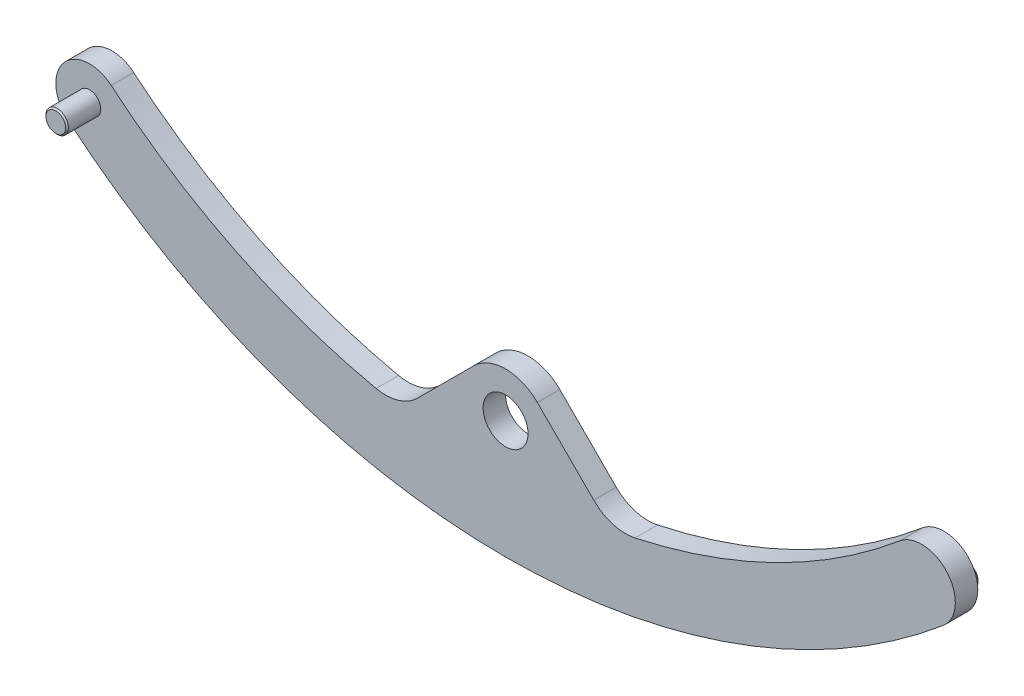
ISO-10303-21;
HEADER;
FILE_DESCRIPTION(('STEP AP214'),'2;1');
FILE_NAME('part.step','',(''),(''),'','','');
FILE_SCHEMA(('AUTOMOTIVE_DESIGN { 1 0 10303 214 1 1 1 1 }'));
ENDSEC;
DATA;
#1=APPLICATION_CONTEXT('core data for automotive mechanical design processes');
#2=APPLICATION_PROTOCOL_DEFINITION('international standard','automotive_design',2000,#1);
#3=PRODUCT_CONTEXT('',#1,'mechanical');
#4=PRODUCT('Part','Part','',(#3));
#5=PRODUCT_RELATED_PRODUCT_CATEGORY('part','',(#4));
#6=PRODUCT_DEFINITION_FORMATION('','',#4);
#7=PRODUCT_DEFINITION_CONTEXT('part definition',#1,'design');
#8=PRODUCT_DEFINITION('design','',#6,#7);
#9=PRODUCT_DEFINITION_SHAPE('','',#8);
#10=(LENGTH_UNIT() NAMED_UNIT(*) SI_UNIT(.MILLI.,.METRE.));
#11=(NAMED_UNIT(*) PLANE_ANGLE_UNIT() SI_UNIT($,.RADIAN.));
#12=(NAMED_UNIT(*) SI_UNIT($,.STERADIAN.) SOLID_ANGLE_UNIT());
#13=UNCERTAINTY_MEASURE_WITH_UNIT(LENGTH_MEASURE(1.E-05),#10,'distance_accuracy_value','');
#14=(GEOMETRIC_REPRESENTATION_CONTEXT(3) GLOBAL_UNCERTAINTY_ASSIGNED_CONTEXT((#13)) GLOBAL_UNIT_ASSIGNED_CONTEXT((#10,
#11,#12)) REPRESENTATION_CONTEXT('',''));
#15=CARTESIAN_POINT('',(0.,0.,0.));
#16=DIRECTION('',(0.,0.,1.));
#17=DIRECTION('',(1.,0.,0.));
#18=AXIS2_PLACEMENT_3D('',#15,#16,#17);
#19=CARTESIAN_POINT('',(0.,0.,4.));
#20=DIRECTION('',(0.,0.,-1.));
#21=DIRECTION('',(-1.,0.,0.));
#22=AXIS2_PLACEMENT_3D('',#19,#20,#21);
#23=CYLINDRICAL_SURFACE('',#22,4.);
#24=CARTESIAN_POINT('',(0.,0.,4.));
#25=DIRECTION('',(0.,0.,1.));
#26=DIRECTION('',(1.,0.,0.));
#27=AXIS2_PLACEMENT_3D('',#24,#25,#26);
#28=CIRCLE('',#27,4.);
#29=CARTESIAN_POINT('',(4.,0.,4.));
#30=VERTEX_POINT('',#29);
#31=EDGE_CURVE('E259',#30,#30,#28,.T.);
#32=ORIENTED_EDGE('',*,*,#31,.T.);
#33=EDGE_LOOP('',(#32));
#34=FACE_BOUND('',#33,.T.);
#35=CARTESIAN_POINT('',(0.,0.,0.));
#36=DIRECTION('',(0.,0.,1.));
#37=DIRECTION('',(1.,0.,0.));
#38=AXIS2_PLACEMENT_3D('',#35,#36,#37);
#39=CIRCLE('',#38,4.);
#40=CARTESIAN_POINT('',(4.,0.,0.));
#41=VERTEX_POINT('',#40);
#42=EDGE_CURVE('E243',#41,#41,#39,.T.);
#43=ORIENTED_EDGE('',*,*,#42,.F.);
#44=EDGE_LOOP('',(#43));
#45=FACE_BOUND('',#44,.T.);
#46=ADVANCED_FACE('F143',(#34,#45),#23,.F.);
#47=CARTESIAN_POINT('',(0.,0.,4.));
#48=DIRECTION('',(0.,0.,-1.));
#49=DIRECTION('',(-1.,0.,0.));
#50=AXIS2_PLACEMENT_3D('',#47,#48,#49);
#51=CYLINDRICAL_SURFACE('',#50,8.);
#52=CARTESIAN_POINT('',(0.,0.,0.));
#53=DIRECTION('',(0.,0.,1.));
#54=DIRECTION('',(1.,0.,0.));
#55=AXIS2_PLACEMENT_3D('',#52,#53,#54);
#56=CIRCLE('',#55,8.);
#57=CARTESIAN_POINT('',(5.65685424949237,5.65685424949239,0.));
#58=VERTEX_POINT('',#57);
#59=CARTESIAN_POINT('',(-5.65685424949237,5.65685424949239,0.));
#60=VERTEX_POINT('',#59);
#61=EDGE_CURVE('E264',#58,#60,#56,.T.);
#62=ORIENTED_EDGE('',*,*,#61,.T.);
#63=DIRECTION('',(0.,0.,-1.));
#64=VECTOR('',#63,1.);
#65=CARTESIAN_POINT('',(-5.65685424949237,5.65685424949239,4.));
#66=LINE('',#65,#64);
#67=CARTESIAN_POINT('',(-5.65685424949237,5.65685424949239,4.));
#68=VERTEX_POINT('',#67);
#69=EDGE_CURVE('E230',#68,#60,#66,.T.);
#70=ORIENTED_EDGE('',*,*,#69,.F.);
#71=CARTESIAN_POINT('',(0.,0.,4.));
#72=DIRECTION('',(0.,0.,1.));
#73=DIRECTION('',(1.,0.,0.));
#74=AXIS2_PLACEMENT_3D('',#71,#72,#73);
#75=CIRCLE('',#74,8.);
#76=CARTESIAN_POINT('',(5.65685424949237,5.65685424949239,4.));
#77=VERTEX_POINT('',#76);
#78=EDGE_CURVE('E233',#77,#68,#75,.T.);
#79=ORIENTED_EDGE('',*,*,#78,.F.);
#80=DIRECTION('',(0.,0.,-1.));
#81=VECTOR('',#80,1.);
#82=CARTESIAN_POINT('',(5.65685424949237,5.65685424949239,4.));
#83=LINE('',#82,#81);
#84=EDGE_CURVE('E218',#77,#58,#83,.T.);
#85=ORIENTED_EDGE('',*,*,#84,.T.);
#86=EDGE_LOOP('',(#62,#70,#79,#85));
#87=FACE_BOUND('',#86,.T.);
#88=ADVANCED_FACE('F234',(#87),#51,.T.);
#89=CARTESIAN_POINT('',(0.,0.,0.));
#90=DIRECTION('',(0.,0.,1.));
#91=DIRECTION('',(1.,0.,0.));
#92=AXIS2_PLACEMENT_3D('',#89,#90,#91);
#93=PLANE('',#92);
#94=CARTESIAN_POINT('',(75.3213201339913,10.4695641574083,0.));
#95=DIRECTION('',(0.,0.,1.));
#96=DIRECTION('',(1.,0.,0.));
#97=AXIS2_PLACEMENT_3D('',#94,#95,#96);
#98=CIRCLE('',#97,2.);
#99=CARTESIAN_POINT('',(77.3213201339913,10.4695641574083,0.));
#100=VERTEX_POINT('',#99);
#101=EDGE_CURVE('E303',#100,#100,#98,.F.);
#102=ORIENTED_EDGE('',*,*,#101,.F.);
#103=EDGE_LOOP('',(#102));
#104=FACE_BOUND('',#103,.T.);
#105=CARTESIAN_POINT('',(0.,100.000003802238,0.));
#106=DIRECTION('',(0.,0.,1.));
#107=DIRECTION('',(1.,0.,0.));
#108=AXIS2_PLACEMENT_3D('',#105,#106,#107);
#109=CIRCLE('',#108,121.000003802238);
#110=CARTESIAN_POINT('',(-77.8964079181355,7.40869452543266,0.));
#111=VERTEX_POINT('',#110);
#112=CARTESIAN_POINT('',(77.8964079181354,7.40869452543262,0.));
#113=VERTEX_POINT('',#112);
#114=EDGE_CURVE('E270',#111,#113,#109,.T.);
#115=ORIENTED_EDGE('',*,*,#114,.F.);
#116=CARTESIAN_POINT('',(-74.0337762419192,11.9999989733962,0.));
#117=DIRECTION('',(0.,0.,1.));
#118=DIRECTION('',(1.,0.,0.));
#119=AXIS2_PLACEMENT_3D('',#116,#117,#118);
#120=CIRCLE('',#119,5.99999999999995);
#121=CARTESIAN_POINT('',(-70.171144565703,16.5913034213598,0.));
#122=VERTEX_POINT('',#121);
#123=EDGE_CURVE('E290',#122,#111,#120,.T.);
#124=ORIENTED_EDGE('',*,*,#123,.F.);
#125=CARTESIAN_POINT('',(0.,100.000003802238,0.));
#126=DIRECTION('',(0.,0.,1.));
#127=DIRECTION('',(1.,0.,0.));
#128=AXIS2_PLACEMENT_3D('',#125,#126,#127);
#129=CIRCLE('',#128,109.000003802238);
#130=CARTESIAN_POINT('',(-23.0367257940233,-6.53783029241069,0.));
#131=VERTEX_POINT('',#130);
#132=EDGE_CURVE('E286',#122,#131,#129,.T.);
#133=ORIENTED_EDGE('',*,*,#132,.T.);
#134=CARTESIAN_POINT('',(-21.3459569873859,1.28146001058367,0.));
#135=DIRECTION('',(0.,0.,1.));
#136=DIRECTION('',(1.,0.,0.));
#137=AXIS2_PLACEMENT_3D('',#134,#135,#136);
#138=CIRCLE('',#137,8.);
#139=CARTESIAN_POINT('',(-15.6891027378935,-4.37539423890872,0.));
#140=VERTEX_POINT('',#139);
#141=EDGE_CURVE('E322',#131,#140,#138,.T.);
#142=ORIENTED_EDGE('',*,*,#141,.T.);
#143=DIRECTION('',(-0.707106781186549,-0.707106781186546,0.));
#144=VECTOR('',#143,1.);
#145=CARTESIAN_POINT('',(-5.65685424949237,5.65685424949239,0.));
#146=LINE('',#145,#144);
#147=EDGE_CURVE('E267',#60,#140,#146,.T.);
#148=ORIENTED_EDGE('',*,*,#147,.F.);
#149=ORIENTED_EDGE('',*,*,#61,.F.);
#150=DIRECTION('',(0.707106781186548,-0.707106781186547,0.));
#151=VECTOR('',#150,1.);
#152=CARTESIAN_POINT('',(5.65685424949238,5.65685424949239,0.));
#153=LINE('',#152,#151);
#154=CARTESIAN_POINT('',(15.6891027378935,-4.3753942389087,0.));
#155=VERTEX_POINT('',#154);
#156=EDGE_CURVE('E225',#58,#155,#153,.T.);
#157=ORIENTED_EDGE('',*,*,#156,.T.);
#158=CARTESIAN_POINT('',(21.3459569873858,1.28146001058367,0.));
#159=DIRECTION('',(0.,0.,1.));
#160=DIRECTION('',(1.,0.,0.));
#161=AXIS2_PLACEMENT_3D('',#158,#159,#160);
#162=CIRCLE('',#161,8.);
#163=CARTESIAN_POINT('',(23.0367257940233,-6.53783029241069,0.));
#164=VERTEX_POINT('',#163);
#165=EDGE_CURVE('E151',#155,#164,#162,.T.);
#166=ORIENTED_EDGE('',*,*,#165,.T.);
#167=CARTESIAN_POINT('',(0.,100.000003802238,0.));
#168=DIRECTION('',(0.,0.,1.));
#169=DIRECTION('',(1.,0.,0.));
#170=AXIS2_PLACEMENT_3D('',#167,#168,#169);
#171=CIRCLE('',#170,109.000003802238);
#172=CARTESIAN_POINT('',(70.1711445657029,16.5913034213598,0.));
#173=VERTEX_POINT('',#172);
#174=EDGE_CURVE('E246',#164,#173,#171,.T.);
#175=ORIENTED_EDGE('',*,*,#174,.T.);
#176=CARTESIAN_POINT('',(74.0337762419192,11.9999989733963,0.));
#177=DIRECTION('',(0.,0.,1.));
#178=DIRECTION('',(1.,0.,0.));
#179=AXIS2_PLACEMENT_3D('',#176,#177,#178);
#180=CIRCLE('',#179,5.99999999999995);
#181=EDGE_CURVE('E272',#113,#173,#180,.T.);
#182=ORIENTED_EDGE('',*,*,#181,.F.);
#183=EDGE_LOOP('',(#115,#124,#133,#142,#148,#149,#157,#166,#175,#182));
#184=FACE_BOUND('',#183,.T.);
#185=ORIENTED_EDGE('',*,*,#42,.T.);
#186=EDGE_LOOP('',(#185));
#187=FACE_BOUND('',#186,.T.);
#188=ADVANCED_FACE('F325',(#104,#184,#187),#93,.F.);
#189=CARTESIAN_POINT('',(0.,100.000003802238,4.));
#190=DIRECTION('',(0.,0.,-1.));
#191=DIRECTION('',(-1.,0.,0.));
#192=AXIS2_PLACEMENT_3D('',#189,#190,#191);
#193=CYLINDRICAL_SURFACE('',#192,121.000003802238);
#194=ORIENTED_EDGE('',*,*,#114,.T.);
#195=DIRECTION('',(0.,0.,-1.));
#196=VECTOR('',#195,1.);
#197=CARTESIAN_POINT('',(77.8964079181354,7.40869452543262,4.));
#198=LINE('',#197,#196);
#199=CARTESIAN_POINT('',(77.8964079181354,7.40869452543262,4.));
#200=VERTEX_POINT('',#199);
#201=EDGE_CURVE('E278',#200,#113,#198,.T.);
#202=ORIENTED_EDGE('',*,*,#201,.F.);
#203=CARTESIAN_POINT('',(0.,100.000003802238,4.));
#204=DIRECTION('',(0.,0.,1.));
#205=DIRECTION('',(1.,0.,0.));
#206=AXIS2_PLACEMENT_3D('',#203,#204,#205);
#207=CIRCLE('',#206,121.000003802238);
#208=CARTESIAN_POINT('',(-77.8964079181355,7.40869452543266,4.));
#209=VERTEX_POINT('',#208);
#210=EDGE_CURVE('E252',#209,#200,#207,.T.);
#211=ORIENTED_EDGE('',*,*,#210,.F.);
#212=DIRECTION('',(0.,0.,-1.));
#213=VECTOR('',#212,1.);
#214=CARTESIAN_POINT('',(-77.8964079181355,7.40869452543266,4.));
#215=LINE('',#214,#213);
#216=EDGE_CURVE('E265',#209,#111,#215,.T.);
#217=ORIENTED_EDGE('',*,*,#216,.T.);
#218=EDGE_LOOP('',(#194,#202,#211,#217));
#219=FACE_BOUND('',#218,.T.);
#220=ADVANCED_FACE('F346',(#219),#193,.T.);
#221=CARTESIAN_POINT('',(0.,100.000003802238,4.));
#222=DIRECTION('',(0.,0.,-1.));
#223=DIRECTION('',(-1.,0.,0.));
#224=AXIS2_PLACEMENT_3D('',#221,#222,#223);
#225=CYLINDRICAL_SURFACE('',#224,109.000003802238);
#226=ORIENTED_EDGE('',*,*,#174,.F.);
#227=DIRECTION('',(0.,0.,-1.));
#228=VECTOR('',#227,1.);
#229=CARTESIAN_POINT('',(23.0367257940233,-6.5378302924107,4.));
#230=LINE('',#229,#228);
#231=CARTESIAN_POINT('',(23.0367257940233,-6.53783029241069,4.));
#232=VERTEX_POINT('',#231);
#233=EDGE_CURVE('E158',#164,#232,#230,.F.);
#234=ORIENTED_EDGE('',*,*,#233,.T.);
#235=CARTESIAN_POINT('',(0.,100.000003802238,4.));
#236=DIRECTION('',(0.,0.,1.));
#237=DIRECTION('',(1.,0.,0.));
#238=AXIS2_PLACEMENT_3D('',#235,#236,#237);
#239=CIRCLE('',#238,109.000003802238);
#240=CARTESIAN_POINT('',(70.1711445657029,16.5913034213598,4.));
#241=VERTEX_POINT('',#240);
#242=EDGE_CURVE('E257',#232,#241,#239,.T.);
#243=ORIENTED_EDGE('',*,*,#242,.T.);
#244=DIRECTION('',(0.,0.,-1.));
#245=VECTOR('',#244,1.);
#246=CARTESIAN_POINT('',(70.1711445657029,16.5913034213598,4.));
#247=LINE('',#246,#245);
#248=EDGE_CURVE('E262',#241,#173,#247,.T.);
#249=ORIENTED_EDGE('',*,*,#248,.T.);
#250=EDGE_LOOP('',(#226,#234,#243,#249));
#251=FACE_BOUND('',#250,.T.);
#252=ADVANCED_FACE('F350',(#251),#225,.F.);
#253=CARTESIAN_POINT('',(74.0337762419192,11.9999989733963,4.));
#254=DIRECTION('',(0.,0.,-1.));
#255=DIRECTION('',(-1.,0.,0.));
#256=AXIS2_PLACEMENT_3D('',#253,#254,#255);
#257=CYLINDRICAL_SURFACE('',#256,5.99999999999995);
#258=ORIENTED_EDGE('',*,*,#181,.T.);
#259=ORIENTED_EDGE('',*,*,#248,.F.);
#260=CARTESIAN_POINT('',(74.0337762419192,11.9999989733963,4.));
#261=DIRECTION('',(0.,0.,1.));
#262=DIRECTION('',(1.,0.,0.));
#263=AXIS2_PLACEMENT_3D('',#260,#261,#262);
#264=CIRCLE('',#263,5.99999999999995);
#265=EDGE_CURVE('E254',#200,#241,#264,.T.);
#266=ORIENTED_EDGE('',*,*,#265,.F.);
#267=ORIENTED_EDGE('',*,*,#201,.T.);
#268=EDGE_LOOP('',(#258,#259,#266,#267));
#269=FACE_BOUND('',#268,.T.);
#270=ADVANCED_FACE('F349',(#269),#257,.T.);
#271=CARTESIAN_POINT('',(0.,0.,4.));
#272=DIRECTION('',(0.,0.,1.));
#273=DIRECTION('',(1.,0.,0.));
#274=AXIS2_PLACEMENT_3D('',#271,#272,#273);
#275=PLANE('',#274);
#276=CARTESIAN_POINT('',(-74.0337762419192,11.9999989733962,4.));
#277=DIRECTION('',(0.,0.,1.));
#278=DIRECTION('',(1.,0.,0.));
#279=AXIS2_PLACEMENT_3D('',#276,#277,#278);
#280=CIRCLE('',#279,2.);
#281=CARTESIAN_POINT('',(-72.0337762419192,11.9999989733962,4.));
#282=VERTEX_POINT('',#281);
#283=EDGE_CURVE('E249',#282,#282,#280,.T.);
#284=ORIENTED_EDGE('',*,*,#283,.F.);
#285=EDGE_LOOP('',(#284));
#286=FACE_BOUND('',#285,.T.);
#287=ORIENTED_EDGE('',*,*,#242,.F.);
#288=CARTESIAN_POINT('',(21.3459569873858,1.28146001058367,4.));
#289=DIRECTION('',(0.,0.,1.));
#290=DIRECTION('',(1.,0.,0.));
#291=AXIS2_PLACEMENT_3D('',#288,#289,#290);
#292=CIRCLE('',#291,8.);
#293=CARTESIAN_POINT('',(15.6891027378935,-4.3753942389087,4.));
#294=VERTEX_POINT('',#293);
#295=EDGE_CURVE('E12',#232,#294,#292,.F.);
#296=ORIENTED_EDGE('',*,*,#295,.T.);
#297=DIRECTION('',(0.707106781186548,-0.707106781186547,0.));
#298=VECTOR('',#297,1.);
#299=CARTESIAN_POINT('',(5.65685424949238,5.65685424949239,4.));
#300=LINE('',#299,#298);
#301=EDGE_CURVE('E223',#77,#294,#300,.T.);
#302=ORIENTED_EDGE('',*,*,#301,.F.);
#303=ORIENTED_EDGE('',*,*,#78,.T.);
#304=DIRECTION('',(-0.707106781186549,-0.707106781186546,0.));
#305=VECTOR('',#304,1.);
#306=CARTESIAN_POINT('',(-5.65685424949237,5.65685424949239,4.));
#307=LINE('',#306,#305);
#308=CARTESIAN_POINT('',(-15.6891027378935,-4.37539423890872,4.));
#309=VERTEX_POINT('',#308);
#310=EDGE_CURVE('E238',#68,#309,#307,.T.);
#311=ORIENTED_EDGE('',*,*,#310,.T.);
#312=CARTESIAN_POINT('',(-21.3459569873859,1.28146001058367,4.));
#313=DIRECTION('',(0.,0.,1.));
#314=DIRECTION('',(1.,0.,0.));
#315=AXIS2_PLACEMENT_3D('',#312,#313,#314);
#316=CIRCLE('',#315,8.);
#317=CARTESIAN_POINT('',(-23.0367257940233,-6.53783029241069,4.));
#318=VERTEX_POINT('',#317);
#319=EDGE_CURVE('E320',#309,#318,#316,.F.);
#320=ORIENTED_EDGE('',*,*,#319,.T.);
#321=CARTESIAN_POINT('',(0.,100.000003802238,4.));
#322=DIRECTION('',(0.,0.,1.));
#323=DIRECTION('',(1.,0.,0.));
#324=AXIS2_PLACEMENT_3D('',#321,#322,#323);
#325=CIRCLE('',#324,109.000003802238);
#326=CARTESIAN_POINT('',(-70.171144565703,16.5913034213598,4.));
#327=VERTEX_POINT('',#326);
#328=EDGE_CURVE('E285',#327,#318,#325,.T.);
#329=ORIENTED_EDGE('',*,*,#328,.F.);
#330=CARTESIAN_POINT('',(-74.0337762419192,11.9999989733962,4.));
#331=DIRECTION('',(0.,0.,1.));
#332=DIRECTION('',(1.,0.,0.));
#333=AXIS2_PLACEMENT_3D('',#330,#331,#332);
#334=CIRCLE('',#333,5.99999999999995);
#335=EDGE_CURVE('E282',#327,#209,#334,.T.);
#336=ORIENTED_EDGE('',*,*,#335,.T.);
#337=ORIENTED_EDGE('',*,*,#210,.T.);
#338=ORIENTED_EDGE('',*,*,#265,.T.);
#339=EDGE_LOOP('',(#287,#296,#302,#303,#311,#320,#329,#336,#337,#338));
#340=FACE_BOUND('',#339,.T.);
#341=ORIENTED_EDGE('',*,*,#31,.F.);
#342=EDGE_LOOP('',(#341));
#343=FACE_BOUND('',#342,.T.);
#344=ADVANCED_FACE('F240',(#286,#340,#343),#275,.T.);
#345=CARTESIAN_POINT('',(-5.65685424949237,5.65685424949239,4.));
#346=DIRECTION('',(0.707106781186546,-0.707106781186549,0.));
#347=DIRECTION('',(0.707106781186549,0.707106781186546,0.));
#348=AXIS2_PLACEMENT_3D('',#345,#346,#347);
#349=PLANE('',#348);
#350=ORIENTED_EDGE('',*,*,#147,.T.);
#351=DIRECTION('',(0.,0.,-1.));
#352=VECTOR('',#351,1.);
#353=CARTESIAN_POINT('',(-15.6891027378935,-4.37539423890872,4.));
#354=LINE('',#353,#352);
#355=EDGE_CURVE('E312',#140,#309,#354,.F.);
#356=ORIENTED_EDGE('',*,*,#355,.T.);
#357=ORIENTED_EDGE('',*,*,#310,.F.);
#358=ORIENTED_EDGE('',*,*,#69,.T.);
#359=EDGE_LOOP('',(#350,#356,#357,#358));
#360=FACE_BOUND('',#359,.T.);
#361=ADVANCED_FACE('F333',(#360),#349,.F.);
#362=CARTESIAN_POINT('',(5.65685424949238,5.65685424949239,4.));
#363=DIRECTION('',(0.707106781186547,0.707106781186548,0.));
#364=DIRECTION('',(-0.707106781186548,0.707106781186547,0.));
#365=AXIS2_PLACEMENT_3D('',#362,#363,#364);
#366=PLANE('',#365);
#367=ORIENTED_EDGE('',*,*,#301,.T.);
#368=DIRECTION('',(0.,0.,1.));
#369=VECTOR('',#368,1.);
#370=CARTESIAN_POINT('',(15.6891027378935,-4.3753942389087,0.));
#371=LINE('',#370,#369);
#372=EDGE_CURVE('E317',#294,#155,#371,.F.);
#373=ORIENTED_EDGE('',*,*,#372,.T.);
#374=ORIENTED_EDGE('',*,*,#156,.F.);
#375=ORIENTED_EDGE('',*,*,#84,.F.);
#376=EDGE_LOOP('',(#367,#373,#374,#375));
#377=FACE_BOUND('',#376,.T.);
#378=ADVANCED_FACE('F220',(#377),#366,.T.);
#379=CARTESIAN_POINT('',(-74.0337762419192,11.9999989733962,4.));
#380=DIRECTION('',(0.,0.,-1.));
#381=DIRECTION('',(-1.,0.,0.));
#382=AXIS2_PLACEMENT_3D('',#379,#380,#381);
#383=CYLINDRICAL_SURFACE('',#382,5.99999999999995);
#384=ORIENTED_EDGE('',*,*,#123,.T.);
#385=ORIENTED_EDGE('',*,*,#216,.F.);
#386=ORIENTED_EDGE('',*,*,#335,.F.);
#387=DIRECTION('',(0.,0.,-1.));
#388=VECTOR('',#387,1.);
#389=CARTESIAN_POINT('',(-70.171144565703,16.5913034213598,4.));
#390=LINE('',#389,#388);
#391=EDGE_CURVE('E289',#327,#122,#390,.T.);
#392=ORIENTED_EDGE('',*,*,#391,.T.);
#393=EDGE_LOOP('',(#384,#385,#386,#392));
#394=FACE_BOUND('',#393,.T.);
#395=ADVANCED_FACE('F341',(#394),#383,.T.);
#396=CARTESIAN_POINT('',(0.,100.000003802238,4.));
#397=DIRECTION('',(0.,0.,-1.));
#398=DIRECTION('',(-1.,0.,0.));
#399=AXIS2_PLACEMENT_3D('',#396,#397,#398);
#400=CYLINDRICAL_SURFACE('',#399,109.000003802238);
#401=ORIENTED_EDGE('',*,*,#328,.T.);
#402=DIRECTION('',(0.,0.,-1.));
#403=VECTOR('',#402,1.);
#404=CARTESIAN_POINT('',(-23.0367257940233,-6.5378302924107,4.));
#405=LINE('',#404,#403);
#406=EDGE_CURVE('E315',#318,#131,#405,.T.);
#407=ORIENTED_EDGE('',*,*,#406,.T.);
#408=ORIENTED_EDGE('',*,*,#132,.F.);
#409=ORIENTED_EDGE('',*,*,#391,.F.);
#410=EDGE_LOOP('',(#401,#407,#408,#409));
#411=FACE_BOUND('',#410,.T.);
#412=ADVANCED_FACE('F337',(#411),#400,.F.);
#413=CARTESIAN_POINT('',(-74.0337762419192,11.9999989733962,10.));
#414=DIRECTION('',(0.,0.,-1.));
#415=DIRECTION('',(-1.,0.,0.));
#416=AXIS2_PLACEMENT_3D('',#413,#414,#415);
#417=CYLINDRICAL_SURFACE('',#416,2.);
#418=CARTESIAN_POINT('',(-74.0337762419192,11.9999989733962,9.75000000000001));
#419=DIRECTION('',(0.,0.,1.));
#420=DIRECTION('',(1.,0.,0.));
#421=AXIS2_PLACEMENT_3D('',#418,#419,#420);
#422=CIRCLE('',#421,2.);
#423=CARTESIAN_POINT('',(-72.0337762419192,11.9999989733962,9.75000000000001));
#424=VERTEX_POINT('',#423);
#425=EDGE_CURVE('E300',#424,#424,#422,.F.);
#426=ORIENTED_EDGE('',*,*,#425,.T.);
#427=EDGE_LOOP('',(#426));
#428=FACE_BOUND('',#427,.T.);
#429=ORIENTED_EDGE('',*,*,#283,.T.);
#430=EDGE_LOOP('',(#429));
#431=FACE_BOUND('',#430,.T.);
#432=ADVANCED_FACE('F382',(#428,#431),#417,.T.);
#433=CARTESIAN_POINT('',(-74.0337762419192,11.9999989733962,10.));
#434=DIRECTION('',(0.,0.,1.));
#435=DIRECTION('',(1.,0.,0.));
#436=AXIS2_PLACEMENT_3D('',#433,#434,#435);
#437=PLANE('',#436);
#438=CARTESIAN_POINT('',(-74.0337762419192,11.9999989733962,10.));
#439=DIRECTION('',(0.,0.,1.));
#440=DIRECTION('',(1.,0.,0.));
#441=AXIS2_PLACEMENT_3D('',#438,#439,#440);
#442=CIRCLE('',#441,1.75000000000002);
#443=CARTESIAN_POINT('',(-72.2837762419192,11.9999989733962,10.));
#444=VERTEX_POINT('',#443);
#445=EDGE_CURVE('E229',#444,#444,#442,.T.);
#446=ORIENTED_EDGE('',*,*,#445,.T.);
#447=EDGE_LOOP('',(#446));
#448=FACE_BOUND('',#447,.T.);
#449=ADVANCED_FACE('F389',(#448),#437,.T.);
#450=CARTESIAN_POINT('',(-74.0337762419192,11.9999989733962,10.));
#451=DIRECTION('',(0.,0.,-1.));
#452=DIRECTION('',(-1.,0.,0.));
#453=AXIS2_PLACEMENT_3D('',#450,#451,#452);
#454=CONICAL_SURFACE('',#453,1.75000000000002,0.785398163397434);
#455=ORIENTED_EDGE('',*,*,#425,.F.);
#456=EDGE_LOOP('',(#455));
#457=FACE_BOUND('',#456,.T.);
#458=ORIENTED_EDGE('',*,*,#445,.F.);
#459=EDGE_LOOP('',(#458));
#460=FACE_BOUND('',#459,.T.);
#461=ADVANCED_FACE('F385',(#457,#460),#454,.T.);
#462=CARTESIAN_POINT('',(75.3213201339913,10.4695641574083,-3.));
#463=DIRECTION('',(0.,0.,1.));
#464=DIRECTION('',(1.,0.,0.));
#465=AXIS2_PLACEMENT_3D('',#462,#463,#464);
#466=CYLINDRICAL_SURFACE('',#465,2.);
#467=CARTESIAN_POINT('',(75.3213201339913,10.4695641574083,-2.75));
#468=DIRECTION('',(0.,0.,-1.));
#469=DIRECTION('',(-1.,0.,0.));
#470=AXIS2_PLACEMENT_3D('',#467,#468,#469);
#471=CIRCLE('',#470,2.);
#472=CARTESIAN_POINT('',(73.3213201339913,10.4695641574083,-2.75));
#473=VERTEX_POINT('',#472);
#474=EDGE_CURVE('E309',#473,#473,#471,.F.);
#475=ORIENTED_EDGE('',*,*,#474,.T.);
#476=EDGE_LOOP('',(#475));
#477=FACE_BOUND('',#476,.T.);
#478=ORIENTED_EDGE('',*,*,#101,.T.);
#479=EDGE_LOOP('',(#478));
#480=FACE_BOUND('',#479,.T.);
#481=ADVANCED_FACE('F388',(#477,#480),#466,.T.);
#482=CARTESIAN_POINT('',(75.3213201339913,10.4695641574083,-3.));
#483=DIRECTION('',(0.,0.,-1.));
#484=DIRECTION('',(-1.,0.,0.));
#485=AXIS2_PLACEMENT_3D('',#482,#483,#484);
#486=PLANE('',#485);
#487=CARTESIAN_POINT('',(75.3213201339913,10.4695641574083,-3.));
#488=DIRECTION('',(0.,0.,-1.));
#489=DIRECTION('',(-1.,0.,0.));
#490=AXIS2_PLACEMENT_3D('',#487,#488,#489);
#491=CIRCLE('',#490,1.74999999999999);
#492=CARTESIAN_POINT('',(73.5713201339913,10.4695641574083,-3.));
#493=VERTEX_POINT('',#492);
#494=EDGE_CURVE('E306',#493,#493,#491,.T.);
#495=ORIENTED_EDGE('',*,*,#494,.T.);
#496=EDGE_LOOP('',(#495));
#497=FACE_BOUND('',#496,.T.);
#498=ADVANCED_FACE('F392',(#497),#486,.T.);
#499=CARTESIAN_POINT('',(75.3213201339913,10.4695641574083,-3.));
#500=DIRECTION('',(0.,0.,1.));
#501=DIRECTION('',(1.,0.,0.));
#502=AXIS2_PLACEMENT_3D('',#499,#500,#501);
#503=CONICAL_SURFACE('',#502,1.74999999999999,0.785398163397462);
#504=ORIENTED_EDGE('',*,*,#474,.F.);
#505=EDGE_LOOP('',(#504));
#506=FACE_BOUND('',#505,.T.);
#507=ORIENTED_EDGE('',*,*,#494,.F.);
#508=EDGE_LOOP('',(#507));
#509=FACE_BOUND('',#508,.T.);
#510=ADVANCED_FACE('F356',(#506,#509),#503,.T.);
#511=CARTESIAN_POINT('',(-21.3459569873859,1.28146001058367,4.));
#512=DIRECTION('',(0.,0.,-1.));
#513=DIRECTION('',(-1.,0.,0.));
#514=AXIS2_PLACEMENT_3D('',#511,#512,#513);
#515=CYLINDRICAL_SURFACE('',#514,8.);
#516=ORIENTED_EDGE('',*,*,#141,.F.);
#517=ORIENTED_EDGE('',*,*,#406,.F.);
#518=ORIENTED_EDGE('',*,*,#319,.F.);
#519=ORIENTED_EDGE('',*,*,#355,.F.);
#520=EDGE_LOOP('',(#516,#517,#518,#519));
#521=FACE_BOUND('',#520,.T.);
#522=ADVANCED_FACE('F334',(#521),#515,.F.);
#523=CARTESIAN_POINT('',(21.3459569873858,1.28146001058367,4.));
#524=DIRECTION('',(0.,0.,-1.));
#525=DIRECTION('',(-1.,0.,0.));
#526=AXIS2_PLACEMENT_3D('',#523,#524,#525);
#527=CYLINDRICAL_SURFACE('',#526,8.);
#528=ORIENTED_EDGE('',*,*,#295,.F.);
#529=ORIENTED_EDGE('',*,*,#233,.F.);
#530=ORIENTED_EDGE('',*,*,#165,.F.);
#531=ORIENTED_EDGE('',*,*,#372,.F.);
#532=EDGE_LOOP('',(#528,#529,#530,#531));
#533=FACE_BOUND('',#532,.T.);
#534=ADVANCED_FACE('F145',(#533),#527,.F.);
#535=CLOSED_SHELL('',(#46,#88,#188,#220,#252,#270,#344,#361,#378,#395,#412,#432,#449,#461,#481,
#498,#510,#522,#534));
#536=MANIFOLD_SOLID_BREP('B2',#535);
#537=ADVANCED_BREP_SHAPE_REPRESENTATION('',(#18,#536),#14);
#538=SHAPE_DEFINITION_REPRESENTATION(#9,#537);
ENDSEC;
END-ISO-10303-21;
